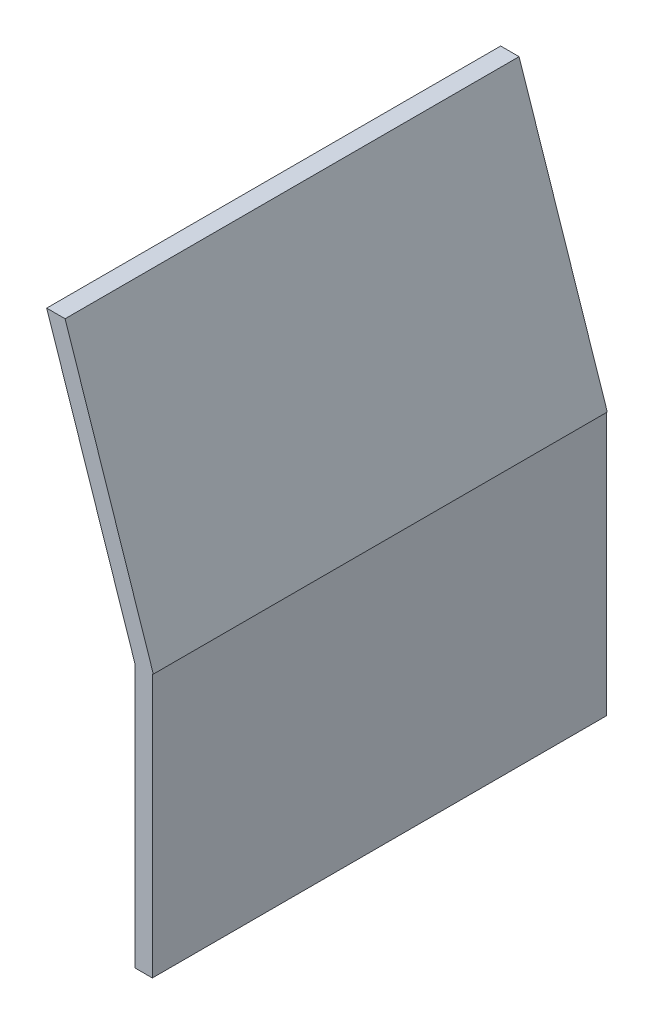
ISO-10303-21;
HEADER;
FILE_DESCRIPTION(('STEP AP214'),'2;1');
FILE_NAME('part.step','',(''),(''),'','','');
FILE_SCHEMA(('AUTOMOTIVE_DESIGN { 1 0 10303 214 1 1 1 1 }'));
ENDSEC;
DATA;
#1=APPLICATION_CONTEXT('core data for automotive mechanical design processes');
#2=APPLICATION_PROTOCOL_DEFINITION('international standard','automotive_design',2000,#1);
#3=PRODUCT_CONTEXT('',#1,'mechanical');
#4=PRODUCT('Part','Part','',(#3));
#5=PRODUCT_RELATED_PRODUCT_CATEGORY('part','',(#4));
#6=PRODUCT_DEFINITION_FORMATION('','',#4);
#7=PRODUCT_DEFINITION_CONTEXT('part definition',#1,'design');
#8=PRODUCT_DEFINITION('design','',#6,#7);
#9=PRODUCT_DEFINITION_SHAPE('','',#8);
#10=(LENGTH_UNIT() NAMED_UNIT(*) SI_UNIT(.MILLI.,.METRE.));
#11=(NAMED_UNIT(*) PLANE_ANGLE_UNIT() SI_UNIT($,.RADIAN.));
#12=(NAMED_UNIT(*) SI_UNIT($,.STERADIAN.) SOLID_ANGLE_UNIT());
#13=UNCERTAINTY_MEASURE_WITH_UNIT(LENGTH_MEASURE(1.E-05),#10,'distance_accuracy_value','');
#14=(GEOMETRIC_REPRESENTATION_CONTEXT(3) GLOBAL_UNCERTAINTY_ASSIGNED_CONTEXT((#13)) GLOBAL_UNIT_ASSIGNED_CONTEXT((#10,
#11,#12)) REPRESENTATION_CONTEXT('',''));
#15=CARTESIAN_POINT('',(0.,0.,0.));
#16=DIRECTION('',(0.,0.,1.));
#17=DIRECTION('',(1.,0.,0.));
#18=AXIS2_PLACEMENT_3D('',#15,#16,#17);
#19=CARTESIAN_POINT('',(505.590903736203,0.,100.));
#20=DIRECTION('',(0.948323655206199,0.317304656405093,0.));
#21=DIRECTION('',(-0.317304656405093,0.948323655206199,0.));
#22=AXIS2_PLACEMENT_3D('',#19,#20,#21);
#23=PLANE('',#22);
#24=DIRECTION('',(-0.317304656405093,0.948323655206199,0.));
#25=VECTOR('',#24,1.);
#26=CARTESIAN_POINT('',(252.971437512137,755.,2700.));
#27=LINE('',#26,#25);
#28=CARTESIAN_POINT('',(505.590903736203,0.,2700.));
#29=VERTEX_POINT('',#28);
#30=CARTESIAN_POINT('',(0.351971288071013,1510.,2700.));
#31=VERTEX_POINT('',#30);
#32=EDGE_CURVE('E9',#29,#31,#27,.T.);
#33=ORIENTED_EDGE('',*,*,#32,.F.);
#34=DIRECTION('',(0.,0.,1.));
#35=VECTOR('',#34,1.);
#36=CARTESIAN_POINT('',(505.590903736203,0.,1400.));
#37=LINE('',#36,#35);
#38=CARTESIAN_POINT('',(505.590903736203,0.,100.));
#39=VERTEX_POINT('',#38);
#40=EDGE_CURVE('E26',#39,#29,#37,.T.);
#41=ORIENTED_EDGE('',*,*,#40,.F.);
#42=DIRECTION('',(-0.317304656405093,0.948323655206199,0.));
#43=VECTOR('',#42,1.);
#44=CARTESIAN_POINT('',(252.971437512137,755.,100.));
#45=LINE('',#44,#43);
#46=CARTESIAN_POINT('',(0.351971288071013,1510.,100.));
#47=VERTEX_POINT('',#46);
#48=EDGE_CURVE('E112',#39,#47,#45,.T.);
#49=ORIENTED_EDGE('',*,*,#48,.T.);
#50=DIRECTION('',(0.,0.,1.));
#51=VECTOR('',#50,1.);
#52=CARTESIAN_POINT('',(0.351971288070843,1510.,1400.));
#53=LINE('',#52,#51);
#54=EDGE_CURVE('E35',#47,#31,#53,.T.);
#55=ORIENTED_EDGE('',*,*,#54,.T.);
#56=EDGE_LOOP('',(#33,#41,#49,#55));
#57=FACE_BOUND('',#56,.T.);
#58=ADVANCED_FACE('F15',(#57),#23,.T.);
#59=CARTESIAN_POINT('',(0.,0.,0.));
#60=DIRECTION('',(0.,1.,0.));
#61=DIRECTION('',(0.,0.,1.));
#62=AXIS2_PLACEMENT_3D('',#59,#60,#61);
#63=PLANE('',#62);
#64=DIRECTION('',(1.,0.,0.));
#65=VECTOR('',#64,1.);
#66=CARTESIAN_POINT('',(502.795451868101,0.,2700.));
#67=LINE('',#66,#65);
#68=CARTESIAN_POINT('',(500.,0.,2700.));
#69=VERTEX_POINT('',#68);
#70=EDGE_CURVE('E153',#69,#29,#67,.T.);
#71=ORIENTED_EDGE('',*,*,#70,.F.);
#72=DIRECTION('',(0.,0.,-1.));
#73=VECTOR('',#72,1.);
#74=CARTESIAN_POINT('',(500.,0.,1400.));
#75=LINE('',#74,#73);
#76=CARTESIAN_POINT('',(500.,0.,100.));
#77=VERTEX_POINT('',#76);
#78=EDGE_CURVE('E90',#69,#77,#75,.T.);
#79=ORIENTED_EDGE('',*,*,#78,.T.);
#80=DIRECTION('',(1.,0.,0.));
#81=VECTOR('',#80,1.);
#82=CARTESIAN_POINT('',(502.795451868101,0.,100.));
#83=LINE('',#82,#81);
#84=EDGE_CURVE('E117',#77,#39,#83,.T.);
#85=ORIENTED_EDGE('',*,*,#84,.T.);
#86=ORIENTED_EDGE('',*,*,#40,.T.);
#87=EDGE_LOOP('',(#71,#79,#85,#86));
#88=FACE_BOUND('',#87,.T.);
#89=ADVANCED_FACE('F186',(#88),#63,.F.);
#90=CARTESIAN_POINT('',(0.351971288071063,1510.,100.));
#91=DIRECTION('',(0.,1.,0.));
#92=DIRECTION('',(0.,0.,1.));
#93=AXIS2_PLACEMENT_3D('',#90,#91,#92);
#94=PLANE('',#93);
#95=DIRECTION('',(-1.,0.,0.));
#96=VECTOR('',#95,1.);
#97=CARTESIAN_POINT('',(-52.3726441167067,1510.,2700.));
#98=LINE('',#97,#96);
#99=CARTESIAN_POINT('',(-105.097259521484,1510.,2700.));
#100=VERTEX_POINT('',#99);
#101=EDGE_CURVE('E149',#31,#100,#98,.T.);
#102=ORIENTED_EDGE('',*,*,#101,.F.);
#103=ORIENTED_EDGE('',*,*,#54,.F.);
#104=DIRECTION('',(-1.,0.,0.));
#105=VECTOR('',#104,1.);
#106=CARTESIAN_POINT('',(-52.3726441167067,1510.,100.));
#107=LINE('',#106,#105);
#108=CARTESIAN_POINT('',(-105.097259521484,1510.,100.));
#109=VERTEX_POINT('',#108);
#110=EDGE_CURVE('E138',#47,#109,#107,.T.);
#111=ORIENTED_EDGE('',*,*,#110,.T.);
#112=DIRECTION('',(0.,0.,1.));
#113=VECTOR('',#112,1.);
#114=CARTESIAN_POINT('',(-105.097259521484,1510.,1400.));
#115=LINE('',#114,#113);
#116=EDGE_CURVE('E135',#109,#100,#115,.T.);
#117=ORIENTED_EDGE('',*,*,#116,.T.);
#118=EDGE_LOOP('',(#102,#103,#111,#117));
#119=FACE_BOUND('',#118,.T.);
#120=ADVANCED_FACE('F174',(#119),#94,.T.);
#121=CARTESIAN_POINT('',(-105.097259521485,1510.,100.));
#122=DIRECTION('',(-0.948323655206199,-0.317304656405093,0.));
#123=DIRECTION('',(0.317304656405093,-0.948323655206199,0.));
#124=AXIS2_PLACEMENT_3D('',#121,#122,#123);
#125=PLANE('',#124);
#126=DIRECTION('',(0.317304656405093,-0.948323655206199,0.));
#127=VECTOR('',#126,1.);
#128=CARTESIAN_POINT('',(147.522206702581,755.,2700.));
#129=LINE('',#128,#127);
#130=CARTESIAN_POINT('',(400.141672926647,0.,2700.));
#131=VERTEX_POINT('',#130);
#132=EDGE_CURVE('E141',#100,#131,#129,.T.);
#133=ORIENTED_EDGE('',*,*,#132,.F.);
#134=ORIENTED_EDGE('',*,*,#116,.F.);
#135=DIRECTION('',(0.317304656405093,-0.948323655206199,0.));
#136=VECTOR('',#135,1.);
#137=CARTESIAN_POINT('',(147.522206702581,755.,100.));
#138=LINE('',#137,#136);
#139=CARTESIAN_POINT('',(400.141672926647,-6.82121026329696E-13,100.));
#140=VERTEX_POINT('',#139);
#141=EDGE_CURVE('E122',#109,#140,#138,.T.);
#142=ORIENTED_EDGE('',*,*,#141,.T.);
#143=DIRECTION('',(0.,0.,1.));
#144=VECTOR('',#143,1.);
#145=CARTESIAN_POINT('',(400.141672926647,-6.82121026329696E-13,1400.));
#146=LINE('',#145,#144);
#147=EDGE_CURVE('E101',#140,#131,#146,.T.);
#148=ORIENTED_EDGE('',*,*,#147,.T.);
#149=EDGE_LOOP('',(#133,#134,#142,#148));
#150=FACE_BOUND('',#149,.T.);
#151=ADVANCED_FACE('F181',(#150),#125,.T.);
#152=CARTESIAN_POINT('',(400.,0.,2700.));
#153=DIRECTION('',(-1.,0.,0.));
#154=DIRECTION('',(0.,0.,1.));
#155=AXIS2_PLACEMENT_3D('',#152,#153,#154);
#156=PLANE('',#155);
#157=DIRECTION('',(0.,0.,-1.));
#158=VECTOR('',#157,1.);
#159=CARTESIAN_POINT('',(400.,-1510.,1400.));
#160=LINE('',#159,#158);
#161=CARTESIAN_POINT('',(400.,-1510.,2700.));
#162=VERTEX_POINT('',#161);
#163=CARTESIAN_POINT('',(400.,-1510.,100.));
#164=VERTEX_POINT('',#163);
#165=EDGE_CURVE('E130',#162,#164,#160,.T.);
#166=ORIENTED_EDGE('',*,*,#165,.F.);
#167=DIRECTION('',(0.,-1.,0.));
#168=VECTOR('',#167,1.);
#169=CARTESIAN_POINT('',(400.,-755.,2700.));
#170=LINE('',#169,#168);
#171=CARTESIAN_POINT('',(400.,0.,2700.));
#172=VERTEX_POINT('',#171);
#173=EDGE_CURVE('E98',#172,#162,#170,.T.);
#174=ORIENTED_EDGE('',*,*,#173,.F.);
#175=DIRECTION('',(0.,0.,1.));
#176=VECTOR('',#175,1.);
#177=CARTESIAN_POINT('',(400.,0.,1400.));
#178=LINE('',#177,#176);
#179=CARTESIAN_POINT('',(400.,0.,100.));
#180=VERTEX_POINT('',#179);
#181=EDGE_CURVE('E126',#180,#172,#178,.T.);
#182=ORIENTED_EDGE('',*,*,#181,.F.);
#183=DIRECTION('',(0.,-1.,0.));
#184=VECTOR('',#183,1.);
#185=CARTESIAN_POINT('',(400.,-755.,100.));
#186=LINE('',#185,#184);
#187=EDGE_CURVE('E116',#180,#164,#186,.T.);
#188=ORIENTED_EDGE('',*,*,#187,.T.);
#189=EDGE_LOOP('',(#166,#174,#182,#188));
#190=FACE_BOUND('',#189,.T.);
#191=ADVANCED_FACE('F188',(#190),#156,.T.);
#192=CARTESIAN_POINT('',(0.,0.,0.));
#193=DIRECTION('',(0.,1.,0.));
#194=DIRECTION('',(0.,0.,1.));
#195=AXIS2_PLACEMENT_3D('',#192,#193,#194);
#196=PLANE('',#195);
#197=ORIENTED_EDGE('',*,*,#147,.F.);
#198=DIRECTION('',(-1.,0.,0.));
#199=VECTOR('',#198,1.);
#200=CARTESIAN_POINT('',(400.070836463323,0.,100.));
#201=LINE('',#200,#199);
#202=EDGE_CURVE('E119',#140,#180,#201,.T.);
#203=ORIENTED_EDGE('',*,*,#202,.T.);
#204=ORIENTED_EDGE('',*,*,#181,.T.);
#205=DIRECTION('',(1.,0.,0.));
#206=VECTOR('',#205,1.);
#207=CARTESIAN_POINT('',(400.070836463323,0.,2700.));
#208=LINE('',#207,#206);
#209=EDGE_CURVE('E107',#172,#131,#208,.T.);
#210=ORIENTED_EDGE('',*,*,#209,.T.);
#211=EDGE_LOOP('',(#197,#203,#204,#210));
#212=FACE_BOUND('',#211,.T.);
#213=ADVANCED_FACE('F183',(#212),#196,.T.);
#214=CARTESIAN_POINT('',(-905.598899303641,-1510.,2700.));
#215=DIRECTION('',(0.,1.,0.));
#216=DIRECTION('',(0.,0.,1.));
#217=AXIS2_PLACEMENT_3D('',#214,#215,#216);
#218=PLANE('',#217);
#219=DIRECTION('',(0.,0.,1.));
#220=VECTOR('',#219,1.);
#221=CARTESIAN_POINT('',(500.,-1510.,1400.));
#222=LINE('',#221,#220);
#223=CARTESIAN_POINT('',(500.,-1510.,100.));
#224=VERTEX_POINT('',#223);
#225=CARTESIAN_POINT('',(500.,-1510.,2700.));
#226=VERTEX_POINT('',#225);
#227=EDGE_CURVE('E81',#224,#226,#222,.T.);
#228=ORIENTED_EDGE('',*,*,#227,.T.);
#229=DIRECTION('',(1.,0.,0.));
#230=VECTOR('',#229,1.);
#231=CARTESIAN_POINT('',(449.999999999999,-1510.,2700.));
#232=LINE('',#231,#230);
#233=EDGE_CURVE('E84',#162,#226,#232,.T.);
#234=ORIENTED_EDGE('',*,*,#233,.F.);
#235=ORIENTED_EDGE('',*,*,#165,.T.);
#236=DIRECTION('',(1.,0.,0.));
#237=VECTOR('',#236,1.);
#238=CARTESIAN_POINT('',(450.,-1510.,100.));
#239=LINE('',#238,#237);
#240=EDGE_CURVE('E78',#164,#224,#239,.T.);
#241=ORIENTED_EDGE('',*,*,#240,.T.);
#242=EDGE_LOOP('',(#228,#234,#235,#241));
#243=FACE_BOUND('',#242,.T.);
#244=ADVANCED_FACE('F83',(#243),#218,.F.);
#245=CARTESIAN_POINT('',(500.,0.,100.));
#246=DIRECTION('',(1.,0.,0.));
#247=DIRECTION('',(0.,0.,-1.));
#248=AXIS2_PLACEMENT_3D('',#245,#246,#247);
#249=PLANE('',#248);
#250=ORIENTED_EDGE('',*,*,#227,.F.);
#251=DIRECTION('',(0.,-1.,0.));
#252=VECTOR('',#251,1.);
#253=CARTESIAN_POINT('',(500.,-755.,100.));
#254=LINE('',#253,#252);
#255=EDGE_CURVE('E19',#77,#224,#254,.T.);
#256=ORIENTED_EDGE('',*,*,#255,.F.);
#257=ORIENTED_EDGE('',*,*,#78,.F.);
#258=DIRECTION('',(0.,-1.,0.));
#259=VECTOR('',#258,1.);
#260=CARTESIAN_POINT('',(500.,-755.,2700.));
#261=LINE('',#260,#259);
#262=EDGE_CURVE('E96',#69,#226,#261,.T.);
#263=ORIENTED_EDGE('',*,*,#262,.T.);
#264=EDGE_LOOP('',(#250,#256,#257,#263));
#265=FACE_BOUND('',#264,.T.);
#266=ADVANCED_FACE('F103',(#265),#249,.T.);
#267=CARTESIAN_POINT('',(399.999999999999,0.,2700.));
#268=DIRECTION('',(0.,0.,-1.));
#269=DIRECTION('',(-1.,0.,0.));
#270=AXIS2_PLACEMENT_3D('',#267,#268,#269);
#271=PLANE('',#270);
#272=ORIENTED_EDGE('',*,*,#70,.T.);
#273=ORIENTED_EDGE('',*,*,#32,.T.);
#274=ORIENTED_EDGE('',*,*,#101,.T.);
#275=ORIENTED_EDGE('',*,*,#132,.T.);
#276=ORIENTED_EDGE('',*,*,#209,.F.);
#277=ORIENTED_EDGE('',*,*,#173,.T.);
#278=ORIENTED_EDGE('',*,*,#233,.T.);
#279=ORIENTED_EDGE('',*,*,#262,.F.);
#280=EDGE_LOOP('',(#272,#273,#274,#275,#276,#277,#278,#279));
#281=FACE_BOUND('',#280,.T.);
#282=ADVANCED_FACE('F95',(#281),#271,.F.);
#283=CARTESIAN_POINT('',(500.,0.,100.));
#284=DIRECTION('',(0.,0.,1.));
#285=DIRECTION('',(1.,0.,0.));
#286=AXIS2_PLACEMENT_3D('',#283,#284,#285);
#287=PLANE('',#286);
#288=ORIENTED_EDGE('',*,*,#48,.F.);
#289=ORIENTED_EDGE('',*,*,#84,.F.);
#290=ORIENTED_EDGE('',*,*,#255,.T.);
#291=ORIENTED_EDGE('',*,*,#240,.F.);
#292=ORIENTED_EDGE('',*,*,#187,.F.);
#293=ORIENTED_EDGE('',*,*,#202,.F.);
#294=ORIENTED_EDGE('',*,*,#141,.F.);
#295=ORIENTED_EDGE('',*,*,#110,.F.);
#296=EDGE_LOOP('',(#288,#289,#290,#291,#292,#293,#294,#295));
#297=FACE_BOUND('',#296,.T.);
#298=ADVANCED_FACE('F17',(#297),#287,.F.);
#299=CLOSED_SHELL('',(#58,#89,#120,#151,#191,#213,#244,#266,#282,#298));
#300=MANIFOLD_SOLID_BREP('B1',#299);
#301=ADVANCED_BREP_SHAPE_REPRESENTATION('',(#18,#300),#14);
#302=SHAPE_DEFINITION_REPRESENTATION(#9,#301);
ENDSEC;
END-ISO-10303-21;
